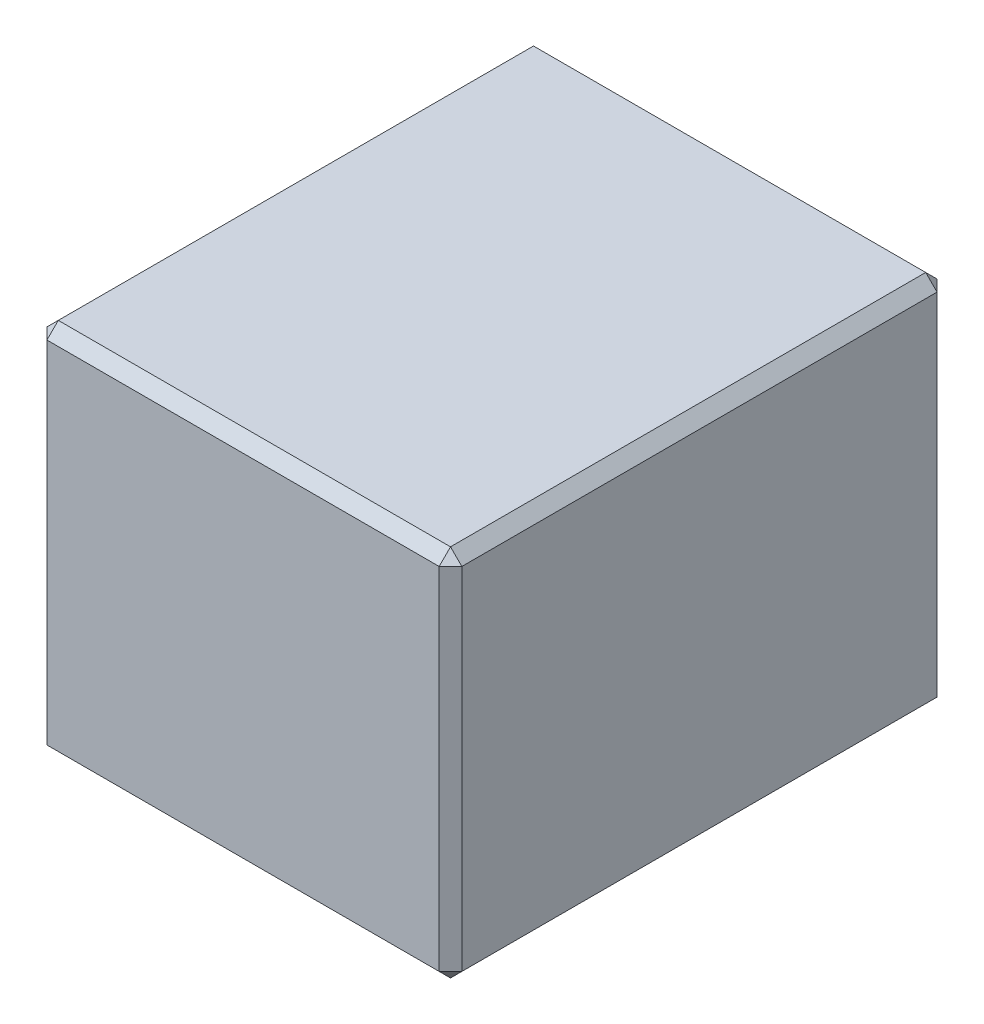
ISO-10303-21;
HEADER;
FILE_DESCRIPTION(('STEP AP214'),'2;1');
FILE_NAME('part.step','',(''),(''),'','','');
FILE_SCHEMA(('AUTOMOTIVE_DESIGN { 1 0 10303 214 1 1 1 1 }'));
ENDSEC;
DATA;
#1=APPLICATION_CONTEXT('core data for automotive mechanical design processes');
#2=APPLICATION_PROTOCOL_DEFINITION('international standard','automotive_design',2000,#1);
#3=PRODUCT_CONTEXT('',#1,'mechanical');
#4=PRODUCT('Part','Part','',(#3));
#5=PRODUCT_RELATED_PRODUCT_CATEGORY('part','',(#4));
#6=PRODUCT_DEFINITION_FORMATION('','',#4);
#7=PRODUCT_DEFINITION_CONTEXT('part definition',#1,'design');
#8=PRODUCT_DEFINITION('design','',#6,#7);
#9=PRODUCT_DEFINITION_SHAPE('','',#8);
#10=(LENGTH_UNIT() NAMED_UNIT(*) SI_UNIT(.MILLI.,.METRE.));
#11=(NAMED_UNIT(*) PLANE_ANGLE_UNIT() SI_UNIT($,.RADIAN.));
#12=(NAMED_UNIT(*) SI_UNIT($,.STERADIAN.) SOLID_ANGLE_UNIT());
#13=UNCERTAINTY_MEASURE_WITH_UNIT(LENGTH_MEASURE(1.E-05),#10,'distance_accuracy_value','');
#14=(GEOMETRIC_REPRESENTATION_CONTEXT(3) GLOBAL_UNCERTAINTY_ASSIGNED_CONTEXT((#13)) GLOBAL_UNIT_ASSIGNED_CONTEXT((#10,
#11,#12)) REPRESENTATION_CONTEXT('',''));
#15=CARTESIAN_POINT('',(0.,0.,0.));
#16=DIRECTION('',(0.,0.,1.));
#17=DIRECTION('',(1.,0.,0.));
#18=AXIS2_PLACEMENT_3D('',#15,#16,#17);
#19=CARTESIAN_POINT('',(508.,914.4,609.6));
#20=DIRECTION('',(-1.,0.,0.));
#21=DIRECTION('',(0.,0.,1.));
#22=AXIS2_PLACEMENT_3D('',#19,#20,#21);
#23=PLANE('',#22);
#24=DIRECTION('',(0.,0.,1.));
#25=VECTOR('',#24,1.);
#26=CARTESIAN_POINT('',(508.,886.62,609.6));
#27=LINE('',#26,#25);
#28=CARTESIAN_POINT('',(508.,886.62,-581.82));
#29=VERTEX_POINT('',#28);
#30=CARTESIAN_POINT('',(508.,886.62,581.82));
#31=VERTEX_POINT('',#30);
#32=EDGE_CURVE('E42',#29,#31,#27,.T.);
#33=ORIENTED_EDGE('',*,*,#32,.T.);
#34=DIRECTION('',(0.,-1.,0.));
#35=VECTOR('',#34,1.);
#36=CARTESIAN_POINT('',(508.,914.4,581.82));
#37=LINE('',#36,#35);
#38=CARTESIAN_POINT('',(508.,27.7799999999999,581.82));
#39=VERTEX_POINT('',#38);
#40=EDGE_CURVE('E11',#31,#39,#37,.T.);
#41=ORIENTED_EDGE('',*,*,#40,.T.);
#42=DIRECTION('',(0.,0.,-1.));
#43=VECTOR('',#42,1.);
#44=CARTESIAN_POINT('',(508.,27.7799999999999,-609.6));
#45=LINE('',#44,#43);
#46=CARTESIAN_POINT('',(508.,27.7799999999999,-581.82));
#47=VERTEX_POINT('',#46);
#48=EDGE_CURVE('E195',#39,#47,#45,.T.);
#49=ORIENTED_EDGE('',*,*,#48,.T.);
#50=DIRECTION('',(0.,1.,0.));
#51=VECTOR('',#50,1.);
#52=CARTESIAN_POINT('',(508.,914.4,-581.82));
#53=LINE('',#52,#51);
#54=EDGE_CURVE('E53',#47,#29,#53,.T.);
#55=ORIENTED_EDGE('',*,*,#54,.T.);
#56=EDGE_LOOP('',(#33,#41,#49,#55));
#57=FACE_BOUND('',#56,.T.);
#58=ADVANCED_FACE('F33',(#57),#23,.F.);
#59=CARTESIAN_POINT('',(-508.,914.4,-609.6));
#60=DIRECTION('',(0.,0.,1.));
#61=DIRECTION('',(1.,0.,0.));
#62=AXIS2_PLACEMENT_3D('',#59,#60,#61);
#63=PLANE('',#62);
#64=DIRECTION('',(-1.,0.,0.));
#65=VECTOR('',#64,1.);
#66=CARTESIAN_POINT('',(-508.,27.7799999999999,-609.6));
#67=LINE('',#66,#65);
#68=CARTESIAN_POINT('',(480.22,27.7799999999999,-609.6));
#69=VERTEX_POINT('',#68);
#70=CARTESIAN_POINT('',(-480.22,27.7799999999999,-609.6));
#71=VERTEX_POINT('',#70);
#72=EDGE_CURVE('E181',#69,#71,#67,.T.);
#73=ORIENTED_EDGE('',*,*,#72,.T.);
#74=DIRECTION('',(0.,1.,0.));
#75=VECTOR('',#74,1.);
#76=CARTESIAN_POINT('',(-480.22,914.4,-609.6));
#77=LINE('',#76,#75);
#78=CARTESIAN_POINT('',(-480.22,886.62,-609.6));
#79=VERTEX_POINT('',#78);
#80=EDGE_CURVE('E183',#71,#79,#77,.T.);
#81=ORIENTED_EDGE('',*,*,#80,.T.);
#82=DIRECTION('',(1.,0.,0.));
#83=VECTOR('',#82,1.);
#84=CARTESIAN_POINT('',(-508.,886.62,-609.6));
#85=LINE('',#84,#83);
#86=CARTESIAN_POINT('',(480.22,886.62,-609.6));
#87=VERTEX_POINT('',#86);
#88=EDGE_CURVE('E179',#79,#87,#85,.T.);
#89=ORIENTED_EDGE('',*,*,#88,.T.);
#90=DIRECTION('',(0.,-1.,0.));
#91=VECTOR('',#90,1.);
#92=CARTESIAN_POINT('',(480.22,914.4,-609.6));
#93=LINE('',#92,#91);
#94=EDGE_CURVE('E177',#87,#69,#93,.T.);
#95=ORIENTED_EDGE('',*,*,#94,.T.);
#96=EDGE_LOOP('',(#73,#81,#89,#95));
#97=FACE_BOUND('',#96,.T.);
#98=ADVANCED_FACE('F266',(#97),#63,.F.);
#99=CARTESIAN_POINT('',(-508.,914.4,609.6));
#100=DIRECTION('',(1.,0.,0.));
#101=DIRECTION('',(0.,0.,-1.));
#102=AXIS2_PLACEMENT_3D('',#99,#100,#101);
#103=PLANE('',#102);
#104=DIRECTION('',(0.,0.,1.));
#105=VECTOR('',#104,1.);
#106=CARTESIAN_POINT('',(-508.,27.7799999999999,609.6));
#107=LINE('',#106,#105);
#108=CARTESIAN_POINT('',(-508.,27.7799999999999,-581.82));
#109=VERTEX_POINT('',#108);
#110=CARTESIAN_POINT('',(-508.,27.7799999999999,581.82));
#111=VERTEX_POINT('',#110);
#112=EDGE_CURVE('E172',#109,#111,#107,.T.);
#113=ORIENTED_EDGE('',*,*,#112,.T.);
#114=DIRECTION('',(0.,1.,0.));
#115=VECTOR('',#114,1.);
#116=CARTESIAN_POINT('',(-508.,914.4,581.82));
#117=LINE('',#116,#115);
#118=CARTESIAN_POINT('',(-508.,886.62,581.82));
#119=VERTEX_POINT('',#118);
#120=EDGE_CURVE('E174',#111,#119,#117,.T.);
#121=ORIENTED_EDGE('',*,*,#120,.T.);
#122=DIRECTION('',(0.,0.,-1.));
#123=VECTOR('',#122,1.);
#124=CARTESIAN_POINT('',(-508.,886.62,609.6));
#125=LINE('',#124,#123);
#126=CARTESIAN_POINT('',(-508.,886.62,-581.82));
#127=VERTEX_POINT('',#126);
#128=EDGE_CURVE('E168',#119,#127,#125,.T.);
#129=ORIENTED_EDGE('',*,*,#128,.T.);
#130=DIRECTION('',(0.,-1.,0.));
#131=VECTOR('',#130,1.);
#132=CARTESIAN_POINT('',(-508.,914.4,-581.82));
#133=LINE('',#132,#131);
#134=EDGE_CURVE('E170',#127,#109,#133,.T.);
#135=ORIENTED_EDGE('',*,*,#134,.T.);
#136=EDGE_LOOP('',(#113,#121,#129,#135));
#137=FACE_BOUND('',#136,.T.);
#138=ADVANCED_FACE('F287',(#137),#103,.F.);
#139=CARTESIAN_POINT('',(-508.,914.4,609.6));
#140=DIRECTION('',(0.,0.,-1.));
#141=DIRECTION('',(-1.,0.,0.));
#142=AXIS2_PLACEMENT_3D('',#139,#140,#141);
#143=PLANE('',#142);
#144=DIRECTION('',(0.,-1.,0.));
#145=VECTOR('',#144,1.);
#146=CARTESIAN_POINT('',(-480.22,914.4,609.6));
#147=LINE('',#146,#145);
#148=CARTESIAN_POINT('',(-480.22,886.62,609.6));
#149=VERTEX_POINT('',#148);
#150=CARTESIAN_POINT('',(-480.22,27.7799999999999,609.6));
#151=VERTEX_POINT('',#150);
#152=EDGE_CURVE('E155',#149,#151,#147,.T.);
#153=ORIENTED_EDGE('',*,*,#152,.T.);
#154=DIRECTION('',(1.,0.,0.));
#155=VECTOR('',#154,1.);
#156=CARTESIAN_POINT('',(508.,27.7799999999999,609.6));
#157=LINE('',#156,#155);
#158=CARTESIAN_POINT('',(480.22,27.7799999999999,609.6));
#159=VERTEX_POINT('',#158);
#160=EDGE_CURVE('E127',#151,#159,#157,.T.);
#161=ORIENTED_EDGE('',*,*,#160,.T.);
#162=DIRECTION('',(0.,1.,0.));
#163=VECTOR('',#162,1.);
#164=CARTESIAN_POINT('',(480.22,914.4,609.6));
#165=LINE('',#164,#163);
#166=CARTESIAN_POINT('',(480.22,886.62,609.6));
#167=VERTEX_POINT('',#166);
#168=EDGE_CURVE('E145',#159,#167,#165,.T.);
#169=ORIENTED_EDGE('',*,*,#168,.T.);
#170=DIRECTION('',(-1.,0.,0.));
#171=VECTOR('',#170,1.);
#172=CARTESIAN_POINT('',(-508.,886.62,609.6));
#173=LINE('',#172,#171);
#174=EDGE_CURVE('E151',#167,#149,#173,.T.);
#175=ORIENTED_EDGE('',*,*,#174,.T.);
#176=EDGE_LOOP('',(#153,#161,#169,#175));
#177=FACE_BOUND('',#176,.T.);
#178=ADVANCED_FACE('F153',(#177),#143,.F.);
#179=CARTESIAN_POINT('',(0.,914.4,0.));
#180=DIRECTION('',(0.,-1.,0.));
#181=DIRECTION('',(0.,0.,-1.));
#182=AXIS2_PLACEMENT_3D('',#179,#180,#181);
#183=PLANE('',#182);
#184=DIRECTION('',(0.,0.,1.));
#185=VECTOR('',#184,1.);
#186=CARTESIAN_POINT('',(-480.22,914.4,0.));
#187=LINE('',#186,#185);
#188=CARTESIAN_POINT('',(-480.22,914.4,-581.82));
#189=VERTEX_POINT('',#188);
#190=CARTESIAN_POINT('',(-480.22,914.4,581.82));
#191=VERTEX_POINT('',#190);
#192=EDGE_CURVE('E190',#189,#191,#187,.T.);
#193=ORIENTED_EDGE('',*,*,#192,.T.);
#194=DIRECTION('',(1.,0.,0.));
#195=VECTOR('',#194,1.);
#196=CARTESIAN_POINT('',(0.,914.4,581.82));
#197=LINE('',#196,#195);
#198=CARTESIAN_POINT('',(480.22,914.4,581.82));
#199=VERTEX_POINT('',#198);
#200=EDGE_CURVE('E192',#191,#199,#197,.T.);
#201=ORIENTED_EDGE('',*,*,#200,.T.);
#202=DIRECTION('',(0.,0.,-1.));
#203=VECTOR('',#202,1.);
#204=CARTESIAN_POINT('',(480.22,914.4,0.));
#205=LINE('',#204,#203);
#206=CARTESIAN_POINT('',(480.22,914.4,-581.82));
#207=VERTEX_POINT('',#206);
#208=EDGE_CURVE('E186',#199,#207,#205,.T.);
#209=ORIENTED_EDGE('',*,*,#208,.T.);
#210=DIRECTION('',(-1.,0.,0.));
#211=VECTOR('',#210,1.);
#212=CARTESIAN_POINT('',(0.,914.4,-581.82));
#213=LINE('',#212,#211);
#214=EDGE_CURVE('E188',#207,#189,#213,.T.);
#215=ORIENTED_EDGE('',*,*,#214,.T.);
#216=EDGE_LOOP('',(#193,#201,#209,#215));
#217=FACE_BOUND('',#216,.T.);
#218=ADVANCED_FACE('F301',(#217),#183,.F.);
#219=CARTESIAN_POINT('',(0.,0.,0.));
#220=DIRECTION('',(0.,-1.,0.));
#221=DIRECTION('',(0.,0.,-1.));
#222=AXIS2_PLACEMENT_3D('',#219,#220,#221);
#223=PLANE('',#222);
#224=DIRECTION('',(0.,0.,1.));
#225=VECTOR('',#224,1.);
#226=CARTESIAN_POINT('',(480.22,0.,609.6));
#227=LINE('',#226,#225);
#228=CARTESIAN_POINT('',(480.22,0.,-581.82));
#229=VERTEX_POINT('',#228);
#230=CARTESIAN_POINT('',(480.22,0.,581.82));
#231=VERTEX_POINT('',#230);
#232=EDGE_CURVE('E157',#229,#231,#227,.T.);
#233=ORIENTED_EDGE('',*,*,#232,.T.);
#234=DIRECTION('',(-1.,0.,0.));
#235=VECTOR('',#234,1.);
#236=CARTESIAN_POINT('',(-508.,0.,581.82));
#237=LINE('',#236,#235);
#238=CARTESIAN_POINT('',(-480.22,0.,581.82));
#239=VERTEX_POINT('',#238);
#240=EDGE_CURVE('E129',#231,#239,#237,.T.);
#241=ORIENTED_EDGE('',*,*,#240,.T.);
#242=DIRECTION('',(0.,0.,-1.));
#243=VECTOR('',#242,1.);
#244=CARTESIAN_POINT('',(-480.22,0.,-609.6));
#245=LINE('',#244,#243);
#246=CARTESIAN_POINT('',(-480.22,0.,-581.82));
#247=VERTEX_POINT('',#246);
#248=EDGE_CURVE('E165',#239,#247,#245,.T.);
#249=ORIENTED_EDGE('',*,*,#248,.T.);
#250=DIRECTION('',(1.,0.,0.));
#251=VECTOR('',#250,1.);
#252=CARTESIAN_POINT('',(508.,0.,-581.82));
#253=LINE('',#252,#251);
#254=EDGE_CURVE('E159',#247,#229,#253,.T.);
#255=ORIENTED_EDGE('',*,*,#254,.T.);
#256=EDGE_LOOP('',(#233,#241,#249,#255));
#257=FACE_BOUND('',#256,.T.);
#258=ADVANCED_FACE('F320',(#257),#223,.T.);
#259=CARTESIAN_POINT('',(0.,914.4,-581.82));
#260=DIRECTION('',(0.,-0.707106781186547,0.707106781186547));
#261=DIRECTION('',(-1.,0.,0.));
#262=AXIS2_PLACEMENT_3D('',#259,#260,#261);
#263=PLANE('',#262);
#264=DIRECTION('',(0.,0.707106781186548,0.707106781186548));
#265=VECTOR('',#264,1.);
#266=CARTESIAN_POINT('',(-480.22,886.62,-609.6));
#267=LINE('',#266,#265);
#268=EDGE_CURVE('E37',#189,#79,#267,.F.);
#269=ORIENTED_EDGE('',*,*,#268,.F.);
#270=ORIENTED_EDGE('',*,*,#214,.F.);
#271=DIRECTION('',(0.,-0.707106781186548,-0.707106781186548));
#272=VECTOR('',#271,1.);
#273=CARTESIAN_POINT('',(480.22,886.62,-609.6));
#274=LINE('',#273,#272);
#275=EDGE_CURVE('E247',#87,#207,#274,.F.);
#276=ORIENTED_EDGE('',*,*,#275,.F.);
#277=ORIENTED_EDGE('',*,*,#88,.F.);
#278=EDGE_LOOP('',(#269,#270,#276,#277));
#279=FACE_BOUND('',#278,.T.);
#280=ADVANCED_FACE('F35',(#279),#263,.F.);
#281=CARTESIAN_POINT('',(-480.22,886.62,-609.6));
#282=DIRECTION('',(-0.577350269189626,0.577350269189626,-0.577350269189626));
#283=DIRECTION('',(-0.707106781186548,0.,0.707106781186548));
#284=AXIS2_PLACEMENT_3D('',#281,#282,#283);
#285=PLANE('',#284);
#286=DIRECTION('',(-0.707106781186548,-0.707106781186548,0.));
#287=VECTOR('',#286,1.);
#288=CARTESIAN_POINT('',(-494.11,900.51,-581.82));
#289=LINE('',#288,#287);
#290=EDGE_CURVE('E243',#189,#127,#289,.T.);
#291=ORIENTED_EDGE('',*,*,#290,.F.);
#292=ORIENTED_EDGE('',*,*,#268,.T.);
#293=DIRECTION('',(0.707106781186548,0.,-0.707106781186548));
#294=VECTOR('',#293,1.);
#295=CARTESIAN_POINT('',(-480.22,886.62,-609.6));
#296=LINE('',#295,#294);
#297=EDGE_CURVE('E246',#127,#79,#296,.T.);
#298=ORIENTED_EDGE('',*,*,#297,.F.);
#299=EDGE_LOOP('',(#291,#292,#298));
#300=FACE_BOUND('',#299,.T.);
#301=ADVANCED_FACE('F259',(#300),#285,.T.);
#302=CARTESIAN_POINT('',(480.22,886.62,-609.6));
#303=DIRECTION('',(0.577350269189626,0.577350269189626,-0.577350269189626));
#304=DIRECTION('',(-0.707106781186548,0.,-0.707106781186548));
#305=AXIS2_PLACEMENT_3D('',#302,#303,#304);
#306=PLANE('',#305);
#307=DIRECTION('',(0.707106781186548,0.,0.707106781186548));
#308=VECTOR('',#307,1.);
#309=CARTESIAN_POINT('',(480.22,886.62,-609.6));
#310=LINE('',#309,#308);
#311=EDGE_CURVE('E238',#87,#29,#310,.T.);
#312=ORIENTED_EDGE('',*,*,#311,.F.);
#313=ORIENTED_EDGE('',*,*,#275,.T.);
#314=DIRECTION('',(-0.707106781186548,0.707106781186548,0.));
#315=VECTOR('',#314,1.);
#316=CARTESIAN_POINT('',(494.11,900.51,-581.82));
#317=LINE('',#316,#315);
#318=EDGE_CURVE('E240',#29,#207,#317,.T.);
#319=ORIENTED_EDGE('',*,*,#318,.F.);
#320=EDGE_LOOP('',(#312,#313,#319));
#321=FACE_BOUND('',#320,.T.);
#322=ADVANCED_FACE('F309',(#321),#306,.T.);
#323=CARTESIAN_POINT('',(-508.,914.4,-581.82));
#324=DIRECTION('',(0.707106781186547,0.,0.707106781186547));
#325=DIRECTION('',(0.,-1.,0.));
#326=AXIS2_PLACEMENT_3D('',#323,#324,#325);
#327=PLANE('',#326);
#328=ORIENTED_EDGE('',*,*,#297,.T.);
#329=ORIENTED_EDGE('',*,*,#80,.F.);
#330=DIRECTION('',(-0.707106781186548,0.,0.707106781186548));
#331=VECTOR('',#330,1.);
#332=CARTESIAN_POINT('',(-494.11,27.7799999999999,-595.71));
#333=LINE('',#332,#331);
#334=EDGE_CURVE('E232',#109,#71,#333,.F.);
#335=ORIENTED_EDGE('',*,*,#334,.F.);
#336=ORIENTED_EDGE('',*,*,#134,.F.);
#337=EDGE_LOOP('',(#328,#329,#335,#336));
#338=FACE_BOUND('',#337,.T.);
#339=ADVANCED_FACE('F271',(#338),#327,.F.);
#340=CARTESIAN_POINT('',(-480.22,914.4,0.));
#341=DIRECTION('',(0.707106781186547,-0.707106781186547,0.));
#342=DIRECTION('',(0.,0.,1.));
#343=AXIS2_PLACEMENT_3D('',#340,#341,#342);
#344=PLANE('',#343);
#345=ORIENTED_EDGE('',*,*,#290,.T.);
#346=ORIENTED_EDGE('',*,*,#128,.F.);
#347=DIRECTION('',(0.707106781186548,0.707106781186548,0.));
#348=VECTOR('',#347,1.);
#349=CARTESIAN_POINT('',(-508.,886.62,581.82));
#350=LINE('',#349,#348);
#351=EDGE_CURVE('E229',#191,#119,#350,.F.);
#352=ORIENTED_EDGE('',*,*,#351,.F.);
#353=ORIENTED_EDGE('',*,*,#192,.F.);
#354=EDGE_LOOP('',(#345,#346,#352,#353));
#355=FACE_BOUND('',#354,.T.);
#356=ADVANCED_FACE('F298',(#355),#344,.F.);
#357=CARTESIAN_POINT('',(0.,914.4,581.82));
#358=DIRECTION('',(0.,-0.707106781186547,-0.707106781186547));
#359=DIRECTION('',(1.,0.,0.));
#360=AXIS2_PLACEMENT_3D('',#357,#358,#359);
#361=PLANE('',#360);
#362=DIRECTION('',(0.,0.707106781186548,-0.707106781186548));
#363=VECTOR('',#362,1.);
#364=CARTESIAN_POINT('',(480.22,914.4,581.82));
#365=LINE('',#364,#363);
#366=EDGE_CURVE('E223',#199,#167,#365,.F.);
#367=ORIENTED_EDGE('',*,*,#366,.F.);
#368=ORIENTED_EDGE('',*,*,#200,.F.);
#369=DIRECTION('',(0.,-0.707106781186548,0.707106781186548));
#370=VECTOR('',#369,1.);
#371=CARTESIAN_POINT('',(-480.22,900.51,595.71));
#372=LINE('',#371,#370);
#373=EDGE_CURVE('E226',#149,#191,#372,.F.);
#374=ORIENTED_EDGE('',*,*,#373,.F.);
#375=ORIENTED_EDGE('',*,*,#174,.F.);
#376=EDGE_LOOP('',(#367,#368,#374,#375));
#377=FACE_BOUND('',#376,.T.);
#378=ADVANCED_FACE('F304',(#377),#361,.F.);
#379=CARTESIAN_POINT('',(480.22,914.4,0.));
#380=DIRECTION('',(-0.707106781186547,-0.707106781186547,0.));
#381=DIRECTION('',(0.,0.,-1.));
#382=AXIS2_PLACEMENT_3D('',#379,#380,#381);
#383=PLANE('',#382);
#384=ORIENTED_EDGE('',*,*,#318,.T.);
#385=ORIENTED_EDGE('',*,*,#208,.F.);
#386=DIRECTION('',(0.707106781186548,-0.707106781186548,0.));
#387=VECTOR('',#386,1.);
#388=CARTESIAN_POINT('',(480.22,914.4,581.82));
#389=LINE('',#388,#387);
#390=EDGE_CURVE('E221',#31,#199,#389,.F.);
#391=ORIENTED_EDGE('',*,*,#390,.F.);
#392=ORIENTED_EDGE('',*,*,#32,.F.);
#393=EDGE_LOOP('',(#384,#385,#391,#392));
#394=FACE_BOUND('',#393,.T.);
#395=ADVANCED_FACE('F308',(#394),#383,.F.);
#396=CARTESIAN_POINT('',(480.22,914.4,-609.6));
#397=DIRECTION('',(-0.707106781186547,0.,0.707106781186547));
#398=DIRECTION('',(0.,-1.,0.));
#399=AXIS2_PLACEMENT_3D('',#396,#397,#398);
#400=PLANE('',#399);
#401=ORIENTED_EDGE('',*,*,#311,.T.);
#402=ORIENTED_EDGE('',*,*,#54,.F.);
#403=DIRECTION('',(-0.707106781186548,0.,-0.707106781186548));
#404=VECTOR('',#403,1.);
#405=CARTESIAN_POINT('',(494.11,27.7799999999999,-595.71));
#406=LINE('',#405,#404);
#407=EDGE_CURVE('E218',#69,#47,#406,.F.);
#408=ORIENTED_EDGE('',*,*,#407,.F.);
#409=ORIENTED_EDGE('',*,*,#94,.F.);
#410=EDGE_LOOP('',(#401,#402,#408,#409));
#411=FACE_BOUND('',#410,.T.);
#412=ADVANCED_FACE('F312',(#411),#400,.F.);
#413=CARTESIAN_POINT('',(-508.,27.7799999999999,-609.6));
#414=DIRECTION('',(0.,-0.707106781186547,-0.707106781186547));
#415=DIRECTION('',(1.,0.,0.));
#416=AXIS2_PLACEMENT_3D('',#413,#414,#415);
#417=PLANE('',#416);
#418=DIRECTION('',(0.,-0.707106781186548,0.707106781186548));
#419=VECTOR('',#418,1.);
#420=CARTESIAN_POINT('',(-480.22,0.,-581.82));
#421=LINE('',#420,#419);
#422=EDGE_CURVE('E235',#71,#247,#421,.T.);
#423=ORIENTED_EDGE('',*,*,#422,.F.);
#424=ORIENTED_EDGE('',*,*,#72,.F.);
#425=DIRECTION('',(0.,0.707106781186548,-0.707106781186548));
#426=VECTOR('',#425,1.);
#427=CARTESIAN_POINT('',(480.22,0.,-581.82));
#428=LINE('',#427,#426);
#429=EDGE_CURVE('E215',#229,#69,#428,.T.);
#430=ORIENTED_EDGE('',*,*,#429,.F.);
#431=ORIENTED_EDGE('',*,*,#254,.F.);
#432=EDGE_LOOP('',(#423,#424,#430,#431));
#433=FACE_BOUND('',#432,.T.);
#434=ADVANCED_FACE('F275',(#433),#417,.T.);
#435=CARTESIAN_POINT('',(-480.22,0.,-581.82));
#436=DIRECTION('',(-0.577350269189626,-0.577350269189626,-0.577350269189626));
#437=DIRECTION('',(-0.707106781186548,0.,0.707106781186548));
#438=AXIS2_PLACEMENT_3D('',#435,#436,#437);
#439=PLANE('',#438);
#440=ORIENTED_EDGE('',*,*,#334,.T.);
#441=ORIENTED_EDGE('',*,*,#422,.T.);
#442=DIRECTION('',(-0.707106781186548,0.707106781186548,0.));
#443=VECTOR('',#442,1.);
#444=CARTESIAN_POINT('',(-480.22,0.,-581.82));
#445=LINE('',#444,#443);
#446=EDGE_CURVE('E212',#109,#247,#445,.F.);
#447=ORIENTED_EDGE('',*,*,#446,.F.);
#448=EDGE_LOOP('',(#440,#441,#447));
#449=FACE_BOUND('',#448,.T.);
#450=ADVANCED_FACE('F279',(#449),#439,.T.);
#451=CARTESIAN_POINT('',(-508.,886.62,581.82));
#452=DIRECTION('',(-0.577350269189626,0.577350269189626,0.577350269189626));
#453=DIRECTION('',(0.707106781186548,0.,0.707106781186548));
#454=AXIS2_PLACEMENT_3D('',#451,#452,#453);
#455=PLANE('',#454);
#456=ORIENTED_EDGE('',*,*,#373,.T.);
#457=ORIENTED_EDGE('',*,*,#351,.T.);
#458=DIRECTION('',(-0.707106781186548,0.,-0.707106781186548));
#459=VECTOR('',#458,1.);
#460=CARTESIAN_POINT('',(-508.,886.62,581.82));
#461=LINE('',#460,#459);
#462=EDGE_CURVE('E210',#149,#119,#461,.T.);
#463=ORIENTED_EDGE('',*,*,#462,.F.);
#464=EDGE_LOOP('',(#456,#457,#463));
#465=FACE_BOUND('',#464,.T.);
#466=ADVANCED_FACE('F295',(#465),#455,.T.);
#467=CARTESIAN_POINT('',(480.22,914.4,581.82));
#468=DIRECTION('',(0.577350269189626,0.577350269189626,0.577350269189626));
#469=DIRECTION('',(0.707106781186548,0.,-0.707106781186548));
#470=AXIS2_PLACEMENT_3D('',#467,#468,#469);
#471=PLANE('',#470);
#472=ORIENTED_EDGE('',*,*,#390,.T.);
#473=ORIENTED_EDGE('',*,*,#366,.T.);
#474=DIRECTION('',(-0.707106781186548,0.,0.707106781186548));
#475=VECTOR('',#474,1.);
#476=CARTESIAN_POINT('',(494.11,886.62,595.71));
#477=LINE('',#476,#475);
#478=EDGE_CURVE('E148',#31,#167,#477,.T.);
#479=ORIENTED_EDGE('',*,*,#478,.F.);
#480=EDGE_LOOP('',(#472,#473,#479));
#481=FACE_BOUND('',#480,.T.);
#482=ADVANCED_FACE('F356',(#481),#471,.T.);
#483=CARTESIAN_POINT('',(480.22,0.,-581.82));
#484=DIRECTION('',(0.577350269189626,-0.577350269189626,-0.577350269189626));
#485=DIRECTION('',(-0.707106781186548,0.,-0.707106781186548));
#486=AXIS2_PLACEMENT_3D('',#483,#484,#485);
#487=PLANE('',#486);
#488=ORIENTED_EDGE('',*,*,#429,.T.);
#489=ORIENTED_EDGE('',*,*,#407,.T.);
#490=DIRECTION('',(-0.707106781186548,-0.707106781186548,0.));
#491=VECTOR('',#490,1.);
#492=CARTESIAN_POINT('',(480.22,0.,-581.82));
#493=LINE('',#492,#491);
#494=EDGE_CURVE('E206',#229,#47,#493,.F.);
#495=ORIENTED_EDGE('',*,*,#494,.F.);
#496=EDGE_LOOP('',(#488,#489,#495));
#497=FACE_BOUND('',#496,.T.);
#498=ADVANCED_FACE('F315',(#497),#487,.T.);
#499=CARTESIAN_POINT('',(-508.,27.7799999999999,609.6));
#500=DIRECTION('',(-0.707106781186547,-0.707106781186547,0.));
#501=DIRECTION('',(0.,0.,-1.));
#502=AXIS2_PLACEMENT_3D('',#499,#500,#501);
#503=PLANE('',#502);
#504=ORIENTED_EDGE('',*,*,#446,.T.);
#505=ORIENTED_EDGE('',*,*,#248,.F.);
#506=DIRECTION('',(0.707106781186548,-0.707106781186548,0.));
#507=VECTOR('',#506,1.);
#508=CARTESIAN_POINT('',(-480.22,0.,581.82));
#509=LINE('',#508,#507);
#510=EDGE_CURVE('E203',#111,#239,#509,.T.);
#511=ORIENTED_EDGE('',*,*,#510,.F.);
#512=ORIENTED_EDGE('',*,*,#112,.F.);
#513=EDGE_LOOP('',(#504,#505,#511,#512));
#514=FACE_BOUND('',#513,.T.);
#515=ADVANCED_FACE('F284',(#514),#503,.T.);
#516=CARTESIAN_POINT('',(-480.22,914.4,609.6));
#517=DIRECTION('',(0.707106781186547,0.,-0.707106781186547));
#518=DIRECTION('',(0.,-1.,0.));
#519=AXIS2_PLACEMENT_3D('',#516,#517,#518);
#520=PLANE('',#519);
#521=ORIENTED_EDGE('',*,*,#462,.T.);
#522=ORIENTED_EDGE('',*,*,#120,.F.);
#523=DIRECTION('',(0.707106781186548,0.,0.707106781186548));
#524=VECTOR('',#523,1.);
#525=CARTESIAN_POINT('',(-494.11,27.7799999999999,595.71));
#526=LINE('',#525,#524);
#527=EDGE_CURVE('E142',#151,#111,#526,.F.);
#528=ORIENTED_EDGE('',*,*,#527,.F.);
#529=ORIENTED_EDGE('',*,*,#152,.F.);
#530=EDGE_LOOP('',(#521,#522,#528,#529));
#531=FACE_BOUND('',#530,.T.);
#532=ADVANCED_FACE('F289',(#531),#520,.F.);
#533=CARTESIAN_POINT('',(508.,914.4,581.82));
#534=DIRECTION('',(-0.707106781186547,0.,-0.707106781186547));
#535=DIRECTION('',(0.,-1.,0.));
#536=AXIS2_PLACEMENT_3D('',#533,#534,#535);
#537=PLANE('',#536);
#538=ORIENTED_EDGE('',*,*,#478,.T.);
#539=ORIENTED_EDGE('',*,*,#168,.F.);
#540=DIRECTION('',(0.707106781186548,0.,-0.707106781186548));
#541=VECTOR('',#540,1.);
#542=CARTESIAN_POINT('',(480.22,27.7799999999999,609.6));
#543=LINE('',#542,#541);
#544=EDGE_CURVE('E134',#39,#159,#543,.F.);
#545=ORIENTED_EDGE('',*,*,#544,.F.);
#546=ORIENTED_EDGE('',*,*,#40,.F.);
#547=EDGE_LOOP('',(#538,#539,#545,#546));
#548=FACE_BOUND('',#547,.T.);
#549=ADVANCED_FACE('F146',(#548),#537,.F.);
#550=CARTESIAN_POINT('',(508.,27.7799999999999,609.6));
#551=DIRECTION('',(0.707106781186547,-0.707106781186547,0.));
#552=DIRECTION('',(0.,0.,1.));
#553=AXIS2_PLACEMENT_3D('',#550,#551,#552);
#554=PLANE('',#553);
#555=ORIENTED_EDGE('',*,*,#494,.T.);
#556=ORIENTED_EDGE('',*,*,#48,.F.);
#557=DIRECTION('',(0.707106781186548,0.707106781186548,0.));
#558=VECTOR('',#557,1.);
#559=CARTESIAN_POINT('',(494.11,13.89,581.82));
#560=LINE('',#559,#558);
#561=EDGE_CURVE('E138',#231,#39,#560,.T.);
#562=ORIENTED_EDGE('',*,*,#561,.F.);
#563=ORIENTED_EDGE('',*,*,#232,.F.);
#564=EDGE_LOOP('',(#555,#556,#562,#563));
#565=FACE_BOUND('',#564,.T.);
#566=ADVANCED_FACE('F318',(#565),#554,.T.);
#567=CARTESIAN_POINT('',(-480.22,0.,581.82));
#568=DIRECTION('',(-0.577350269189626,-0.577350269189626,0.577350269189626));
#569=DIRECTION('',(0.707106781186548,0.,0.707106781186548));
#570=AXIS2_PLACEMENT_3D('',#567,#568,#569);
#571=PLANE('',#570);
#572=ORIENTED_EDGE('',*,*,#527,.T.);
#573=ORIENTED_EDGE('',*,*,#510,.T.);
#574=DIRECTION('',(0.,0.707106781186548,0.707106781186548));
#575=VECTOR('',#574,1.);
#576=CARTESIAN_POINT('',(-480.22,0.,581.82));
#577=LINE('',#576,#575);
#578=EDGE_CURVE('E131',#151,#239,#577,.F.);
#579=ORIENTED_EDGE('',*,*,#578,.F.);
#580=EDGE_LOOP('',(#572,#573,#579));
#581=FACE_BOUND('',#580,.T.);
#582=ADVANCED_FACE('F342',(#581),#571,.T.);
#583=CARTESIAN_POINT('',(480.22,27.7799999999999,609.6));
#584=DIRECTION('',(0.577350269189626,-0.577350269189626,0.577350269189626));
#585=DIRECTION('',(0.707106781186548,0.,-0.707106781186548));
#586=AXIS2_PLACEMENT_3D('',#583,#584,#585);
#587=PLANE('',#586);
#588=ORIENTED_EDGE('',*,*,#561,.T.);
#589=ORIENTED_EDGE('',*,*,#544,.T.);
#590=DIRECTION('',(0.,-0.707106781186548,-0.707106781186548));
#591=VECTOR('',#590,1.);
#592=CARTESIAN_POINT('',(480.22,27.7799999999999,609.6));
#593=LINE('',#592,#591);
#594=EDGE_CURVE('E123',#231,#159,#593,.F.);
#595=ORIENTED_EDGE('',*,*,#594,.F.);
#596=EDGE_LOOP('',(#588,#589,#595));
#597=FACE_BOUND('',#596,.T.);
#598=ADVANCED_FACE('F136',(#597),#587,.T.);
#599=CARTESIAN_POINT('',(-508.,27.7799999999999,609.6));
#600=DIRECTION('',(0.,-0.707106781186547,0.707106781186547));
#601=DIRECTION('',(-1.,0.,0.));
#602=AXIS2_PLACEMENT_3D('',#599,#600,#601);
#603=PLANE('',#602);
#604=ORIENTED_EDGE('',*,*,#578,.T.);
#605=ORIENTED_EDGE('',*,*,#240,.F.);
#606=ORIENTED_EDGE('',*,*,#594,.T.);
#607=ORIENTED_EDGE('',*,*,#160,.F.);
#608=EDGE_LOOP('',(#604,#605,#606,#607));
#609=FACE_BOUND('',#608,.T.);
#610=ADVANCED_FACE('F125',(#609),#603,.T.);
#611=CLOSED_SHELL('',(#58,#98,#138,#178,#218,#258,#280,#301,#322,#339,#356,#378,#395,#412,#434,
#450,#466,#482,#498,#515,#532,#549,#566,#582,#598,#610));
#612=MANIFOLD_SOLID_BREP('B2',#611);
#613=ADVANCED_BREP_SHAPE_REPRESENTATION('',(#18,#612),#14);
#614=SHAPE_DEFINITION_REPRESENTATION(#9,#613);
ENDSEC;
END-ISO-10303-21;
